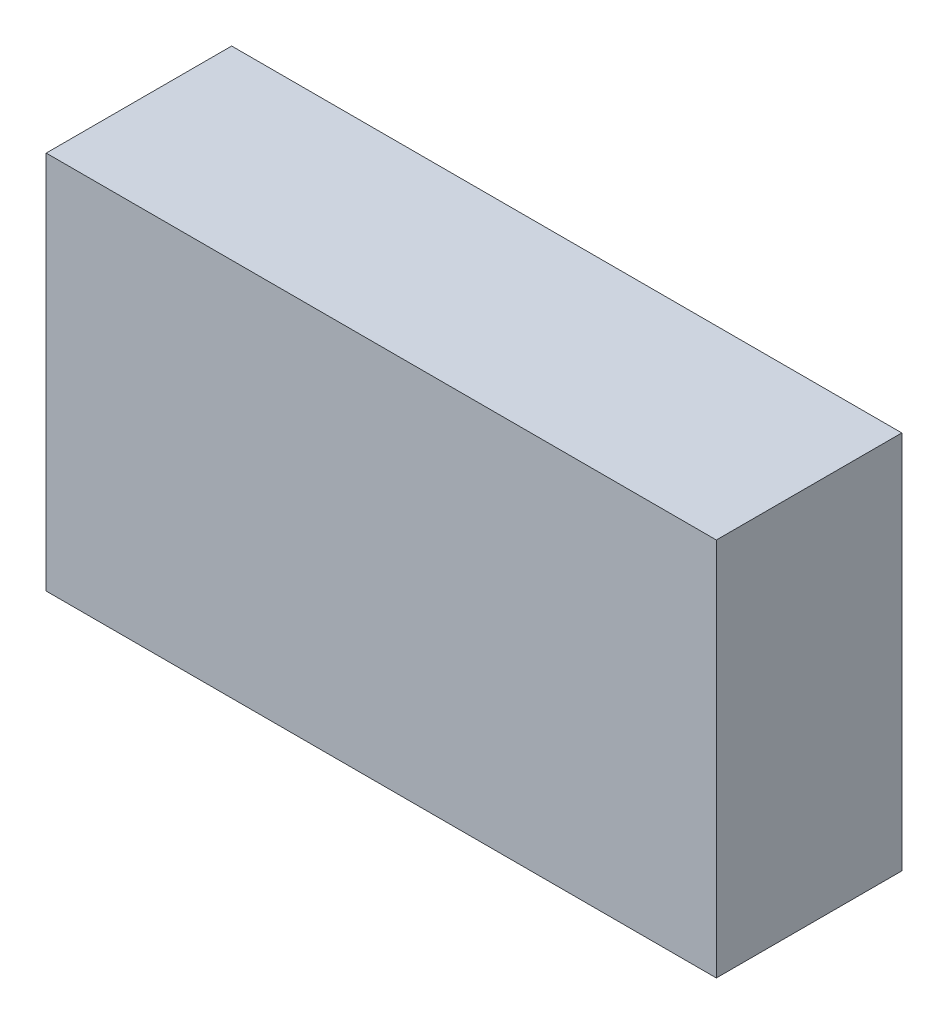
ISO-10303-21;
HEADER;
FILE_DESCRIPTION(('STEP AP214'),'2;1');
FILE_NAME('part.step','',(''),(''),'','','');
FILE_SCHEMA(('AUTOMOTIVE_DESIGN { 1 0 10303 214 1 1 1 1 }'));
ENDSEC;
DATA;
#1=APPLICATION_CONTEXT('core data for automotive mechanical design processes');
#2=APPLICATION_PROTOCOL_DEFINITION('international standard','automotive_design',2000,#1);
#3=PRODUCT_CONTEXT('',#1,'mechanical');
#4=PRODUCT('Part','Part','',(#3));
#5=PRODUCT_RELATED_PRODUCT_CATEGORY('part','',(#4));
#6=PRODUCT_DEFINITION_FORMATION('','',#4);
#7=PRODUCT_DEFINITION_CONTEXT('part definition',#1,'design');
#8=PRODUCT_DEFINITION('design','',#6,#7);
#9=PRODUCT_DEFINITION_SHAPE('','',#8);
#10=(LENGTH_UNIT() NAMED_UNIT(*) SI_UNIT(.MILLI.,.METRE.));
#11=(NAMED_UNIT(*) PLANE_ANGLE_UNIT() SI_UNIT($,.RADIAN.));
#12=(NAMED_UNIT(*) SI_UNIT($,.STERADIAN.) SOLID_ANGLE_UNIT());
#13=UNCERTAINTY_MEASURE_WITH_UNIT(LENGTH_MEASURE(1.E-05),#10,'distance_accuracy_value','');
#14=(GEOMETRIC_REPRESENTATION_CONTEXT(3) GLOBAL_UNCERTAINTY_ASSIGNED_CONTEXT((#13)) GLOBAL_UNIT_ASSIGNED_CONTEXT((#10,
#11,#12)) REPRESENTATION_CONTEXT('',''));
#15=CARTESIAN_POINT('',(0.,0.,0.));
#16=DIRECTION('',(0.,0.,1.));
#17=DIRECTION('',(1.,0.,0.));
#18=AXIS2_PLACEMENT_3D('',#15,#16,#17);
#19=CARTESIAN_POINT('',(0.055,0.,0.495));
#20=DIRECTION('',(0.,0.,1.));
#21=DIRECTION('',(1.,0.,0.));
#22=AXIS2_PLACEMENT_3D('',#19,#20,#21);
#23=PLANE('',#22);
#24=DIRECTION('',(0.,1.,0.));
#25=VECTOR('',#24,1.);
#26=CARTESIAN_POINT('',(1.645,0.,0.495));
#27=LINE('',#26,#25);
#28=CARTESIAN_POINT('',(1.645,0.9,0.495));
#29=VERTEX_POINT('',#28);
#30=CARTESIAN_POINT('',(1.645,0.,0.495));
#31=VERTEX_POINT('',#30);
#32=EDGE_CURVE('E76',#29,#31,#27,.F.);
#33=ORIENTED_EDGE('',*,*,#32,.F.);
#34=DIRECTION('',(1.,0.,0.));
#35=VECTOR('',#34,1.);
#36=CARTESIAN_POINT('',(0.055,0.9,0.495));
#37=LINE('',#36,#35);
#38=CARTESIAN_POINT('',(0.055,0.9,0.495));
#39=VERTEX_POINT('',#38);
#40=EDGE_CURVE('E58',#39,#29,#37,.T.);
#41=ORIENTED_EDGE('',*,*,#40,.F.);
#42=DIRECTION('',(0.,1.,0.));
#43=VECTOR('',#42,1.);
#44=CARTESIAN_POINT('',(0.055,0.,0.495));
#45=LINE('',#44,#43);
#46=CARTESIAN_POINT('',(0.055,0.,0.495));
#47=VERTEX_POINT('',#46);
#48=EDGE_CURVE('E20',#39,#47,#45,.F.);
#49=ORIENTED_EDGE('',*,*,#48,.T.);
#50=DIRECTION('',(1.,0.,0.));
#51=VECTOR('',#50,1.);
#52=CARTESIAN_POINT('',(0.055,0.,0.495));
#53=LINE('',#52,#51);
#54=EDGE_CURVE('E55',#47,#31,#53,.T.);
#55=ORIENTED_EDGE('',*,*,#54,.T.);
#56=EDGE_LOOP('',(#33,#41,#49,#55));
#57=FACE_BOUND('',#56,.T.);
#58=ADVANCED_FACE('F17',(#57),#23,.T.);
#59=CARTESIAN_POINT('',(0.055,0.,0.055));
#60=DIRECTION('',(1.,0.,0.));
#61=DIRECTION('',(0.,0.,-1.));
#62=AXIS2_PLACEMENT_3D('',#59,#60,#61);
#63=PLANE('',#62);
#64=DIRECTION('',(0.,0.,1.));
#65=VECTOR('',#64,1.);
#66=CARTESIAN_POINT('',(0.055,0.9,0.055));
#67=LINE('',#66,#65);
#68=CARTESIAN_POINT('',(0.055,0.9,0.055));
#69=VERTEX_POINT('',#68);
#70=EDGE_CURVE('E78',#69,#39,#67,.T.);
#71=ORIENTED_EDGE('',*,*,#70,.F.);
#72=DIRECTION('',(0.,1.,0.));
#73=VECTOR('',#72,1.);
#74=CARTESIAN_POINT('',(0.055,0.,0.055));
#75=LINE('',#74,#73);
#76=CARTESIAN_POINT('',(0.055,0.,0.055));
#77=VERTEX_POINT('',#76);
#78=EDGE_CURVE('E73',#69,#77,#75,.F.);
#79=ORIENTED_EDGE('',*,*,#78,.T.);
#80=DIRECTION('',(0.,0.,1.));
#81=VECTOR('',#80,1.);
#82=CARTESIAN_POINT('',(0.055,0.,0.055));
#83=LINE('',#82,#81);
#84=EDGE_CURVE('E63',#77,#47,#83,.T.);
#85=ORIENTED_EDGE('',*,*,#84,.T.);
#86=ORIENTED_EDGE('',*,*,#48,.F.);
#87=EDGE_LOOP('',(#71,#79,#85,#86));
#88=FACE_BOUND('',#87,.T.);
#89=ADVANCED_FACE('F72',(#88),#63,.F.);
#90=CARTESIAN_POINT('',(0.055,0.,0.055));
#91=DIRECTION('',(0.,1.,0.));
#92=DIRECTION('',(0.,0.,1.));
#93=AXIS2_PLACEMENT_3D('',#90,#91,#92);
#94=PLANE('',#93);
#95=ORIENTED_EDGE('',*,*,#54,.F.);
#96=ORIENTED_EDGE('',*,*,#84,.F.);
#97=DIRECTION('',(1.,0.,0.));
#98=VECTOR('',#97,1.);
#99=CARTESIAN_POINT('',(0.055,0.,0.055));
#100=LINE('',#99,#98);
#101=CARTESIAN_POINT('',(1.645,0.,0.055));
#102=VERTEX_POINT('',#101);
#103=EDGE_CURVE('E83',#77,#102,#100,.T.);
#104=ORIENTED_EDGE('',*,*,#103,.T.);
#105=DIRECTION('',(0.,0.,-1.));
#106=VECTOR('',#105,1.);
#107=CARTESIAN_POINT('',(1.645,0.,0.055));
#108=LINE('',#107,#106);
#109=EDGE_CURVE('E69',#31,#102,#108,.T.);
#110=ORIENTED_EDGE('',*,*,#109,.F.);
#111=EDGE_LOOP('',(#95,#96,#104,#110));
#112=FACE_BOUND('',#111,.T.);
#113=ADVANCED_FACE('F66',(#112),#94,.F.);
#114=CARTESIAN_POINT('',(1.645,0.,0.055));
#115=DIRECTION('',(1.,0.,0.));
#116=DIRECTION('',(0.,0.,-1.));
#117=AXIS2_PLACEMENT_3D('',#114,#115,#116);
#118=PLANE('',#117);
#119=DIRECTION('',(0.,0.,1.));
#120=VECTOR('',#119,1.);
#121=CARTESIAN_POINT('',(1.645,0.9,0.055));
#122=LINE('',#121,#120);
#123=CARTESIAN_POINT('',(1.645,0.9,0.055));
#124=VERTEX_POINT('',#123);
#125=EDGE_CURVE('E34',#29,#124,#122,.F.);
#126=ORIENTED_EDGE('',*,*,#125,.F.);
#127=ORIENTED_EDGE('',*,*,#32,.T.);
#128=ORIENTED_EDGE('',*,*,#109,.T.);
#129=DIRECTION('',(0.,1.,0.));
#130=VECTOR('',#129,1.);
#131=CARTESIAN_POINT('',(1.645,0.,0.055));
#132=LINE('',#131,#130);
#133=EDGE_CURVE('E26',#102,#124,#132,.T.);
#134=ORIENTED_EDGE('',*,*,#133,.T.);
#135=EDGE_LOOP('',(#126,#127,#128,#134));
#136=FACE_BOUND('',#135,.T.);
#137=ADVANCED_FACE('F88',(#136),#118,.T.);
#138=CARTESIAN_POINT('',(0.055,0.9,0.055));
#139=DIRECTION('',(0.,1.,0.));
#140=DIRECTION('',(0.,0.,1.));
#141=AXIS2_PLACEMENT_3D('',#138,#139,#140);
#142=PLANE('',#141);
#143=ORIENTED_EDGE('',*,*,#40,.T.);
#144=ORIENTED_EDGE('',*,*,#125,.T.);
#145=DIRECTION('',(1.,0.,0.));
#146=VECTOR('',#145,1.);
#147=CARTESIAN_POINT('',(0.055,0.9,0.055));
#148=LINE('',#147,#146);
#149=EDGE_CURVE('E11',#124,#69,#148,.F.);
#150=ORIENTED_EDGE('',*,*,#149,.T.);
#151=ORIENTED_EDGE('',*,*,#70,.T.);
#152=EDGE_LOOP('',(#143,#144,#150,#151));
#153=FACE_BOUND('',#152,.T.);
#154=ADVANCED_FACE('F91',(#153),#142,.T.);
#155=CARTESIAN_POINT('',(0.055,0.,0.055));
#156=DIRECTION('',(0.,0.,1.));
#157=DIRECTION('',(1.,0.,0.));
#158=AXIS2_PLACEMENT_3D('',#155,#156,#157);
#159=PLANE('',#158);
#160=ORIENTED_EDGE('',*,*,#133,.F.);
#161=ORIENTED_EDGE('',*,*,#103,.F.);
#162=ORIENTED_EDGE('',*,*,#78,.F.);
#163=ORIENTED_EDGE('',*,*,#149,.F.);
#164=EDGE_LOOP('',(#160,#161,#162,#163));
#165=FACE_BOUND('',#164,.T.);
#166=ADVANCED_FACE('F90',(#165),#159,.F.);
#167=CLOSED_SHELL('',(#58,#89,#113,#137,#154,#166));
#168=MANIFOLD_SOLID_BREP('B1',#167);
#169=ADVANCED_BREP_SHAPE_REPRESENTATION('',(#18,#168),#14);
#170=SHAPE_DEFINITION_REPRESENTATION(#9,#169);
ENDSEC;
END-ISO-10303-21;
